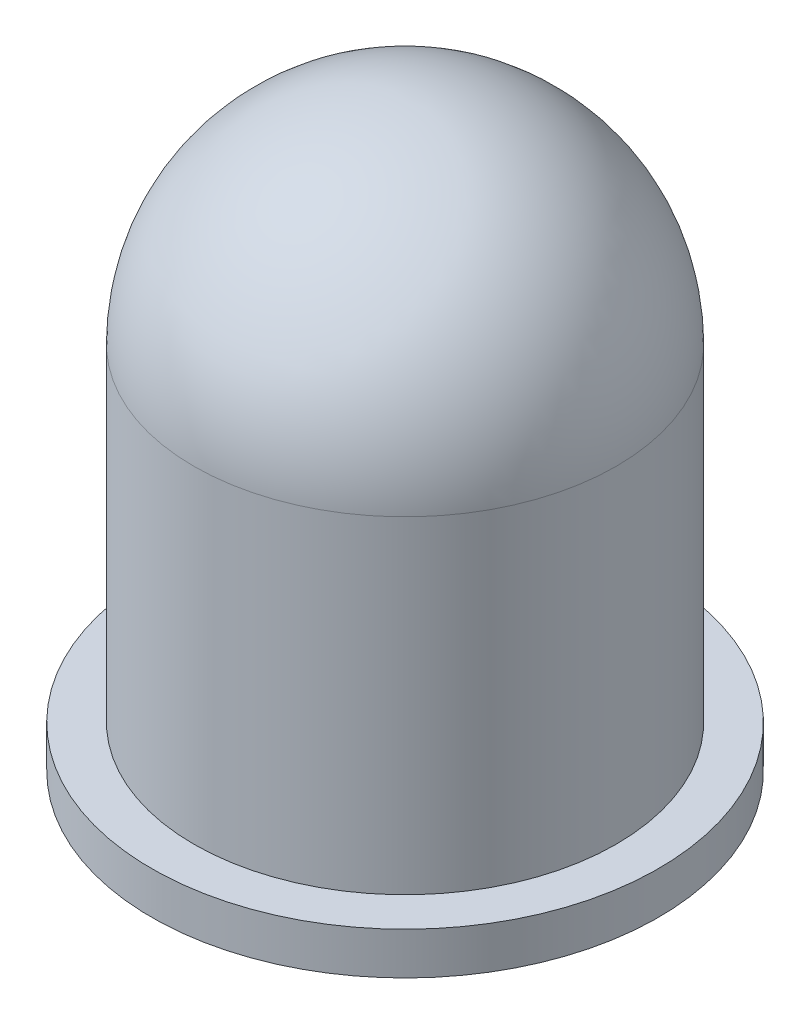
ISO-10303-21;
HEADER;
FILE_DESCRIPTION(('STEP AP214'),'2;1');
FILE_NAME('part.step','',(''),(''),'','','');
FILE_SCHEMA(('AUTOMOTIVE_DESIGN { 1 0 10303 214 1 1 1 1 }'));
ENDSEC;
DATA;
#1=APPLICATION_CONTEXT('core data for automotive mechanical design processes');
#2=APPLICATION_PROTOCOL_DEFINITION('international standard','automotive_design',2000,#1);
#3=PRODUCT_CONTEXT('',#1,'mechanical');
#4=PRODUCT('Part','Part','',(#3));
#5=PRODUCT_RELATED_PRODUCT_CATEGORY('part','',(#4));
#6=PRODUCT_DEFINITION_FORMATION('','',#4);
#7=PRODUCT_DEFINITION_CONTEXT('part definition',#1,'design');
#8=PRODUCT_DEFINITION('design','',#6,#7);
#9=PRODUCT_DEFINITION_SHAPE('','',#8);
#10=(LENGTH_UNIT() NAMED_UNIT(*) SI_UNIT(.MILLI.,.METRE.));
#11=(NAMED_UNIT(*) PLANE_ANGLE_UNIT() SI_UNIT($,.RADIAN.));
#12=(NAMED_UNIT(*) SI_UNIT($,.STERADIAN.) SOLID_ANGLE_UNIT());
#13=UNCERTAINTY_MEASURE_WITH_UNIT(LENGTH_MEASURE(1.E-05),#10,'distance_accuracy_value','');
#14=(GEOMETRIC_REPRESENTATION_CONTEXT(3) GLOBAL_UNCERTAINTY_ASSIGNED_CONTEXT((#13)) GLOBAL_UNIT_ASSIGNED_CONTEXT((#10,
#11,#12)) REPRESENTATION_CONTEXT('',''));
#15=CARTESIAN_POINT('',(0.,0.,0.));
#16=DIRECTION('',(0.,0.,1.));
#17=DIRECTION('',(1.,0.,0.));
#18=AXIS2_PLACEMENT_3D('',#15,#16,#17);
#19=CARTESIAN_POINT('',(0.,0.,0.));
#20=DIRECTION('',(0.,-1.,0.));
#21=DIRECTION('',(0.,0.,-1.));
#22=AXIS2_PLACEMENT_3D('',#19,#20,#21);
#23=PLANE('',#22);
#24=CARTESIAN_POINT('',(0.,0.,0.));
#25=DIRECTION('',(0.,-1.,0.));
#26=DIRECTION('',(0.,0.,-1.));
#27=AXIS2_PLACEMENT_3D('',#24,#25,#26);
#28=CIRCLE('',#27,4.8);
#29=CARTESIAN_POINT('',(0.,0.,-4.8));
#30=VERTEX_POINT('',#29);
#31=EDGE_CURVE('E10',#30,#30,#28,.T.);
#32=ORIENTED_EDGE('',*,*,#31,.T.);
#33=EDGE_LOOP('',(#32));
#34=FACE_BOUND('',#33,.T.);
#35=ADVANCED_FACE('F39',(#34),#23,.T.);
#36=CARTESIAN_POINT('',(0.,0.,0.));
#37=DIRECTION('',(0.,-1.,0.));
#38=DIRECTION('',(0.,0.,-1.));
#39=AXIS2_PLACEMENT_3D('',#36,#37,#38);
#40=CYLINDRICAL_SURFACE('',#39,4.8);
#41=CARTESIAN_POINT('',(0.,0.799999999999999,0.));
#42=DIRECTION('',(0.,-1.,0.));
#43=DIRECTION('',(0.,0.,-1.));
#44=AXIS2_PLACEMENT_3D('',#41,#42,#43);
#45=CIRCLE('',#44,4.8);
#46=CARTESIAN_POINT('',(0.,0.799999999999999,-4.8));
#47=VERTEX_POINT('',#46);
#48=EDGE_CURVE('E46',#47,#47,#45,.T.);
#49=ORIENTED_EDGE('',*,*,#48,.T.);
#50=EDGE_LOOP('',(#49));
#51=FACE_BOUND('',#50,.T.);
#52=ORIENTED_EDGE('',*,*,#31,.F.);
#53=EDGE_LOOP('',(#52));
#54=FACE_BOUND('',#53,.T.);
#55=ADVANCED_FACE('F75',(#51,#54),#40,.T.);
#56=CARTESIAN_POINT('',(4.8,0.8,0.));
#57=DIRECTION('',(0.,1.,0.));
#58=DIRECTION('',(0.,0.,1.));
#59=AXIS2_PLACEMENT_3D('',#56,#57,#58);
#60=PLANE('',#59);
#61=CARTESIAN_POINT('',(0.,0.8,0.));
#62=DIRECTION('',(0.,-1.,0.));
#63=DIRECTION('',(0.,0.,-1.));
#64=AXIS2_PLACEMENT_3D('',#61,#62,#63);
#65=CIRCLE('',#64,4.);
#66=CARTESIAN_POINT('',(0.,0.8,-4.));
#67=VERTEX_POINT('',#66);
#68=EDGE_CURVE('E52',#67,#67,#65,.T.);
#69=ORIENTED_EDGE('',*,*,#68,.T.);
#70=EDGE_LOOP('',(#69));
#71=FACE_BOUND('',#70,.T.);
#72=ORIENTED_EDGE('',*,*,#48,.F.);
#73=EDGE_LOOP('',(#72));
#74=FACE_BOUND('',#73,.T.);
#75=ADVANCED_FACE('F72',(#71,#74),#60,.T.);
#76=CARTESIAN_POINT('',(0.,0.,0.));
#77=DIRECTION('',(0.,-1.,0.));
#78=DIRECTION('',(0.,0.,-1.));
#79=AXIS2_PLACEMENT_3D('',#76,#77,#78);
#80=CYLINDRICAL_SURFACE('',#79,4.);
#81=CARTESIAN_POINT('',(0.,7.,0.));
#82=DIRECTION('',(0.,-1.,0.));
#83=DIRECTION('',(0.,0.,-1.));
#84=AXIS2_PLACEMENT_3D('',#81,#82,#83);
#85=CIRCLE('',#84,4.);
#86=CARTESIAN_POINT('',(0.,7.,-4.));
#87=VERTEX_POINT('',#86);
#88=EDGE_CURVE('E57',#87,#87,#85,.T.);
#89=ORIENTED_EDGE('',*,*,#88,.T.);
#90=EDGE_LOOP('',(#89));
#91=FACE_BOUND('',#90,.T.);
#92=ORIENTED_EDGE('',*,*,#68,.F.);
#93=EDGE_LOOP('',(#92));
#94=FACE_BOUND('',#93,.T.);
#95=ADVANCED_FACE('F63',(#91,#94),#80,.T.);
#96=CARTESIAN_POINT('',(0.,7.,0.));
#97=DIRECTION('',(0.,-1.,0.));
#98=DIRECTION('',(1.,0.,0.));
#99=AXIS2_PLACEMENT_3D('',#96,#97,#98);
#100=SPHERICAL_SURFACE('',#99,4.);
#101=ORIENTED_EDGE('',*,*,#88,.F.);
#102=EDGE_LOOP('',(#101));
#103=FACE_BOUND('',#102,.T.);
#104=ADVANCED_FACE('F66',(#103),#100,.T.);
#105=CLOSED_SHELL('',(#35,#55,#75,#95,#104));
#106=MANIFOLD_SOLID_BREP('B2',#105);
#107=ADVANCED_BREP_SHAPE_REPRESENTATION('',(#18,#106),#14);
#108=SHAPE_DEFINITION_REPRESENTATION(#9,#107);
ENDSEC;
END-ISO-10303-21;
